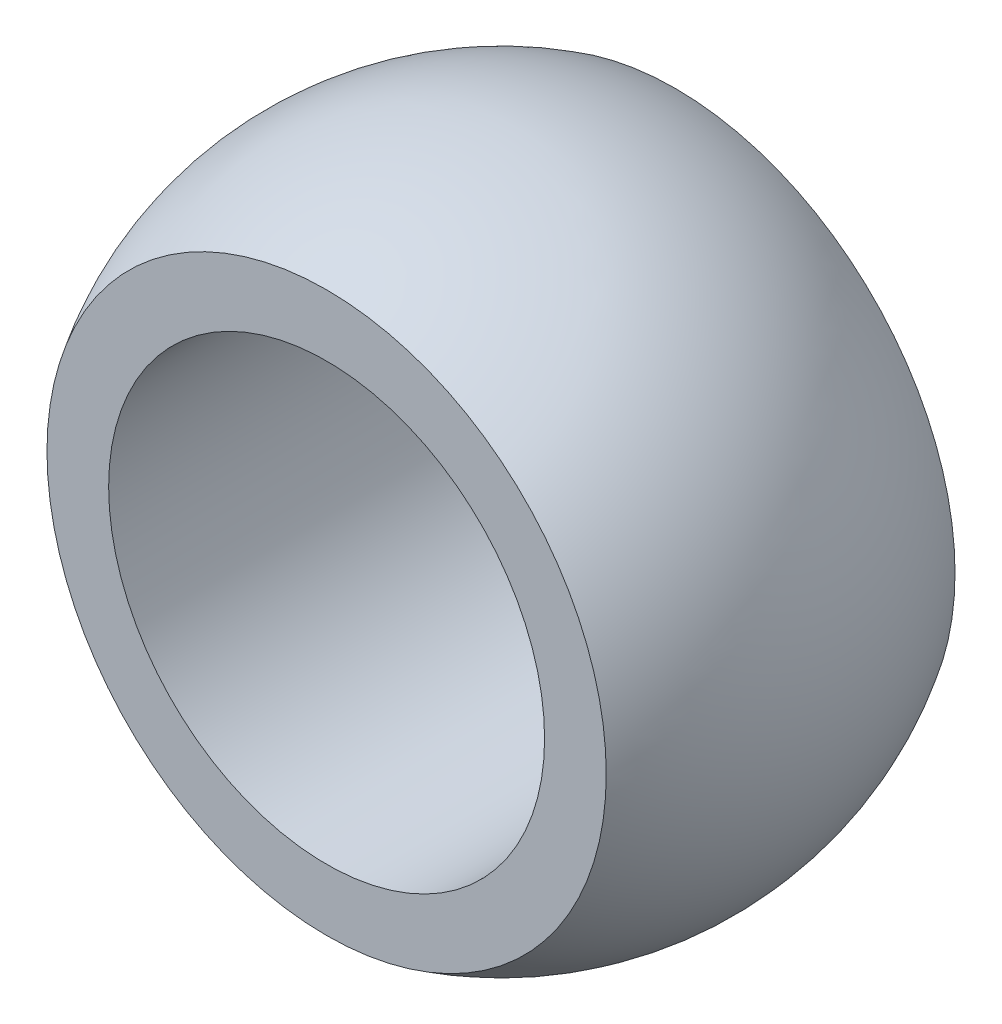
ISO-10303-21;
HEADER;
FILE_DESCRIPTION(('STEP AP214'),'2;1');
FILE_NAME('part.step','',(''),(''),'','','');
FILE_SCHEMA(('AUTOMOTIVE_DESIGN { 1 0 10303 214 1 1 1 1 }'));
ENDSEC;
DATA;
#1=APPLICATION_CONTEXT('core data for automotive mechanical design processes');
#2=APPLICATION_PROTOCOL_DEFINITION('international standard','automotive_design',2000,#1);
#3=PRODUCT_CONTEXT('',#1,'mechanical');
#4=PRODUCT('Part','Part','',(#3));
#5=PRODUCT_RELATED_PRODUCT_CATEGORY('part','',(#4));
#6=PRODUCT_DEFINITION_FORMATION('','',#4);
#7=PRODUCT_DEFINITION_CONTEXT('part definition',#1,'design');
#8=PRODUCT_DEFINITION('design','',#6,#7);
#9=PRODUCT_DEFINITION_SHAPE('','',#8);
#10=(LENGTH_UNIT() NAMED_UNIT(*) SI_UNIT(.MILLI.,.METRE.));
#11=(NAMED_UNIT(*) PLANE_ANGLE_UNIT() SI_UNIT($,.RADIAN.));
#12=(NAMED_UNIT(*) SI_UNIT($,.STERADIAN.) SOLID_ANGLE_UNIT());
#13=UNCERTAINTY_MEASURE_WITH_UNIT(LENGTH_MEASURE(1.E-05),#10,'distance_accuracy_value','');
#14=(GEOMETRIC_REPRESENTATION_CONTEXT(3) GLOBAL_UNCERTAINTY_ASSIGNED_CONTEXT((#13)) GLOBAL_UNIT_ASSIGNED_CONTEXT((#10,
#11,#12)) REPRESENTATION_CONTEXT('',''));
#15=CARTESIAN_POINT('',(0.,0.,0.));
#16=DIRECTION('',(0.,0.,1.));
#17=DIRECTION('',(1.,0.,0.));
#18=AXIS2_PLACEMENT_3D('',#15,#16,#17);
#19=CARTESIAN_POINT('',(0.,0.,0.));
#20=DIRECTION('',(0.,0.,-1.));
#21=DIRECTION('',(1.,0.,0.));
#22=AXIS2_PLACEMENT_3D('',#19,#20,#21);
#23=SPHERICAL_SURFACE('',#22,12.00023);
#24=CARTESIAN_POINT('',(0.,0.,-6.35));
#25=DIRECTION('',(0.,0.,1.));
#26=DIRECTION('',(0.,-1.,0.));
#27=AXIS2_PLACEMENT_3D('',#24,#25,#26);
#28=CIRCLE('',#27,10.1824859466095);
#29=CARTESIAN_POINT('',(0.,-10.1824859466095,-6.35));
#30=VERTEX_POINT('',#29);
#31=EDGE_CURVE('E10',#30,#30,#28,.T.);
#32=ORIENTED_EDGE('',*,*,#31,.T.);
#33=EDGE_LOOP('',(#32));
#34=FACE_BOUND('',#33,.T.);
#35=CARTESIAN_POINT('',(0.,0.,6.35));
#36=DIRECTION('',(0.,0.,1.));
#37=DIRECTION('',(1.,0.,0.));
#38=AXIS2_PLACEMENT_3D('',#35,#36,#37);
#39=CIRCLE('',#38,10.1824859466095);
#40=CARTESIAN_POINT('',(10.1824859466095,0.,6.35));
#41=VERTEX_POINT('',#40);
#42=EDGE_CURVE('E37',#41,#41,#39,.T.);
#43=ORIENTED_EDGE('',*,*,#42,.F.);
#44=EDGE_LOOP('',(#43));
#45=FACE_BOUND('',#44,.T.);
#46=ADVANCED_FACE('F31',(#34,#45),#23,.T.);
#47=CARTESIAN_POINT('',(-12.00023,0.,6.35));
#48=DIRECTION('',(0.,0.,1.));
#49=DIRECTION('',(1.,0.,0.));
#50=AXIS2_PLACEMENT_3D('',#47,#48,#49);
#51=PLANE('',#50);
#52=CARTESIAN_POINT('',(0.,0.,6.35));
#53=DIRECTION('',(0.,0.,1.));
#54=DIRECTION('',(1.,0.,0.));
#55=AXIS2_PLACEMENT_3D('',#52,#53,#54);
#56=CIRCLE('',#55,7.9375);
#57=CARTESIAN_POINT('',(7.9375,0.,6.35));
#58=VERTEX_POINT('',#57);
#59=EDGE_CURVE('E45',#58,#58,#56,.T.);
#60=ORIENTED_EDGE('',*,*,#59,.F.);
#61=EDGE_LOOP('',(#60));
#62=FACE_BOUND('',#61,.T.);
#63=ORIENTED_EDGE('',*,*,#42,.T.);
#64=EDGE_LOOP('',(#63));
#65=FACE_BOUND('',#64,.T.);
#66=ADVANCED_FACE('F53',(#62,#65),#51,.T.);
#67=CARTESIAN_POINT('',(-12.00023,0.,-6.35));
#68=DIRECTION('',(0.,0.,1.));
#69=DIRECTION('',(0.,-1.,0.));
#70=AXIS2_PLACEMENT_3D('',#67,#68,#69);
#71=PLANE('',#70);
#72=CARTESIAN_POINT('',(0.,0.,-6.35));
#73=DIRECTION('',(0.,0.,1.));
#74=DIRECTION('',(1.,0.,0.));
#75=AXIS2_PLACEMENT_3D('',#72,#73,#74);
#76=CIRCLE('',#75,7.9375);
#77=CARTESIAN_POINT('',(7.9375,0.,-6.35));
#78=VERTEX_POINT('',#77);
#79=EDGE_CURVE('E41',#78,#78,#76,.T.);
#80=ORIENTED_EDGE('',*,*,#79,.T.);
#81=EDGE_LOOP('',(#80));
#82=FACE_BOUND('',#81,.T.);
#83=ORIENTED_EDGE('',*,*,#31,.F.);
#84=EDGE_LOOP('',(#83));
#85=FACE_BOUND('',#84,.T.);
#86=ADVANCED_FACE('F55',(#82,#85),#71,.F.);
#87=CARTESIAN_POINT('',(0.,0.,-6.35));
#88=DIRECTION('',(0.,0.,1.));
#89=DIRECTION('',(1.,0.,0.));
#90=AXIS2_PLACEMENT_3D('',#87,#88,#89);
#91=CYLINDRICAL_SURFACE('',#90,7.9375);
#92=ORIENTED_EDGE('',*,*,#79,.F.);
#93=EDGE_LOOP('',(#92));
#94=FACE_BOUND('',#93,.T.);
#95=ORIENTED_EDGE('',*,*,#59,.T.);
#96=EDGE_LOOP('',(#95));
#97=FACE_BOUND('',#96,.T.);
#98=ADVANCED_FACE('F51',(#94,#97),#91,.F.);
#99=CLOSED_SHELL('',(#46,#66,#86,#98));
#100=MANIFOLD_SOLID_BREP('B2',#99);
#101=ADVANCED_BREP_SHAPE_REPRESENTATION('',(#18,#100),#14);
#102=SHAPE_DEFINITION_REPRESENTATION(#9,#101);
ENDSEC;
END-ISO-10303-21;
